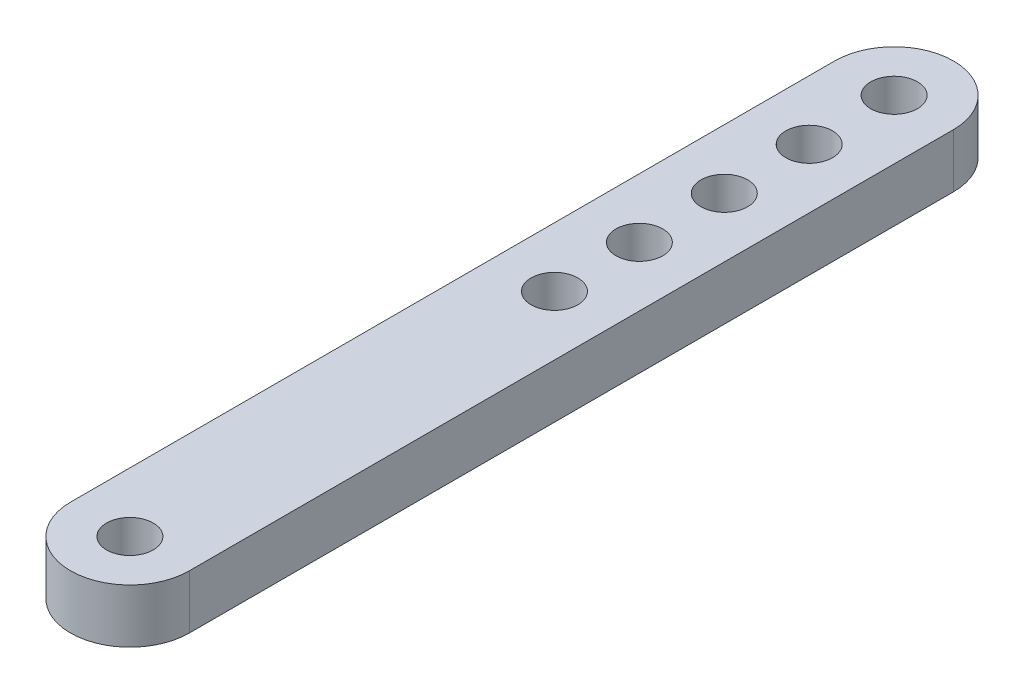
ISO-10303-21;
HEADER;
FILE_DESCRIPTION(('STEP AP214'),'2;1');
FILE_NAME('part.step','',(''),(''),'','','');
FILE_SCHEMA(('AUTOMOTIVE_DESIGN { 1 0 10303 214 1 1 1 1 }'));
ENDSEC;
DATA;
#1=APPLICATION_CONTEXT('core data for automotive mechanical design processes');
#2=APPLICATION_PROTOCOL_DEFINITION('international standard','automotive_design',2000,#1);
#3=PRODUCT_CONTEXT('',#1,'mechanical');
#4=PRODUCT('Part','Part','',(#3));
#5=PRODUCT_RELATED_PRODUCT_CATEGORY('part','',(#4));
#6=PRODUCT_DEFINITION_FORMATION('','',#4);
#7=PRODUCT_DEFINITION_CONTEXT('part definition',#1,'design');
#8=PRODUCT_DEFINITION('design','',#6,#7);
#9=PRODUCT_DEFINITION_SHAPE('','',#8);
#10=(LENGTH_UNIT() NAMED_UNIT(*) SI_UNIT(.MILLI.,.METRE.));
#11=(NAMED_UNIT(*) PLANE_ANGLE_UNIT() SI_UNIT($,.RADIAN.));
#12=(NAMED_UNIT(*) SI_UNIT($,.STERADIAN.) SOLID_ANGLE_UNIT());
#13=UNCERTAINTY_MEASURE_WITH_UNIT(LENGTH_MEASURE(1.E-05),#10,'distance_accuracy_value','');
#14=(GEOMETRIC_REPRESENTATION_CONTEXT(3) GLOBAL_UNCERTAINTY_ASSIGNED_CONTEXT((#13)) GLOBAL_UNIT_ASSIGNED_CONTEXT((#10,
#11,#12)) REPRESENTATION_CONTEXT('',''));
#15=CARTESIAN_POINT('',(0.,0.,0.));
#16=DIRECTION('',(0.,0.,1.));
#17=DIRECTION('',(1.,0.,0.));
#18=AXIS2_PLACEMENT_3D('',#15,#16,#17);
#19=CARTESIAN_POINT('',(0.,6.35,-90.));
#20=DIRECTION('',(0.,1.,0.));
#21=DIRECTION('',(0.,0.,1.));
#22=AXIS2_PLACEMENT_3D('',#19,#20,#21);
#23=PLANE('',#22);
#24=CARTESIAN_POINT('',(0.,6.35,-80.));
#25=DIRECTION('',(0.,1.,0.));
#26=DIRECTION('',(0.,0.,1.));
#27=AXIS2_PLACEMENT_3D('',#24,#25,#26);
#28=CIRCLE('',#27,2.75000000000001);
#29=CARTESIAN_POINT('',(0.,6.35,-77.25));
#30=VERTEX_POINT('',#29);
#31=EDGE_CURVE('E129',#30,#30,#28,.T.);
#32=ORIENTED_EDGE('',*,*,#31,.F.);
#33=EDGE_LOOP('',(#32));
#34=FACE_BOUND('',#33,.T.);
#35=CARTESIAN_POINT('',(0.,6.35,-70.));
#36=DIRECTION('',(0.,1.,0.));
#37=DIRECTION('',(0.,0.,1.));
#38=AXIS2_PLACEMENT_3D('',#35,#36,#37);
#39=CIRCLE('',#38,2.75000000000001);
#40=CARTESIAN_POINT('',(0.,6.35,-67.25));
#41=VERTEX_POINT('',#40);
#42=EDGE_CURVE('E147',#41,#41,#39,.T.);
#43=ORIENTED_EDGE('',*,*,#42,.F.);
#44=EDGE_LOOP('',(#43));
#45=FACE_BOUND('',#44,.T.);
#46=CARTESIAN_POINT('',(0.,6.35,-60.));
#47=DIRECTION('',(0.,1.,0.));
#48=DIRECTION('',(0.,0.,1.));
#49=AXIS2_PLACEMENT_3D('',#46,#47,#48);
#50=CIRCLE('',#49,2.75000000000001);
#51=CARTESIAN_POINT('',(0.,6.35,-57.25));
#52=VERTEX_POINT('',#51);
#53=EDGE_CURVE('E141',#52,#52,#50,.T.);
#54=ORIENTED_EDGE('',*,*,#53,.F.);
#55=EDGE_LOOP('',(#54));
#56=FACE_BOUND('',#55,.T.);
#57=CARTESIAN_POINT('',(0.,6.35,-50.));
#58=DIRECTION('',(0.,1.,0.));
#59=DIRECTION('',(0.,0.,1.));
#60=AXIS2_PLACEMENT_3D('',#57,#58,#59);
#61=CIRCLE('',#60,2.75000000000001);
#62=CARTESIAN_POINT('',(0.,6.35,-47.25));
#63=VERTEX_POINT('',#62);
#64=EDGE_CURVE('E135',#63,#63,#61,.T.);
#65=ORIENTED_EDGE('',*,*,#64,.F.);
#66=EDGE_LOOP('',(#65));
#67=FACE_BOUND('',#66,.T.);
#68=CARTESIAN_POINT('',(0.,6.35,-90.));
#69=DIRECTION('',(0.,1.,0.));
#70=DIRECTION('',(0.,0.,1.));
#71=AXIS2_PLACEMENT_3D('',#68,#69,#70);
#72=CIRCLE('',#71,2.75);
#73=CARTESIAN_POINT('',(0.,6.35,-87.25));
#74=VERTEX_POINT('',#73);
#75=EDGE_CURVE('E108',#74,#74,#72,.T.);
#76=ORIENTED_EDGE('',*,*,#75,.F.);
#77=EDGE_LOOP('',(#76));
#78=FACE_BOUND('',#77,.T.);
#79=CARTESIAN_POINT('',(0.,6.35,-90.));
#80=DIRECTION('',(0.,1.,0.));
#81=DIRECTION('',(0.,0.,1.));
#82=AXIS2_PLACEMENT_3D('',#79,#80,#81);
#83=CIRCLE('',#82,7.00000000000001);
#84=CARTESIAN_POINT('',(7.,6.35,-90.));
#85=VERTEX_POINT('',#84);
#86=CARTESIAN_POINT('',(-7.00000000000002,6.35,-90.));
#87=VERTEX_POINT('',#86);
#88=EDGE_CURVE('E93',#85,#87,#83,.T.);
#89=ORIENTED_EDGE('',*,*,#88,.T.);
#90=DIRECTION('',(0.,0.,1.));
#91=VECTOR('',#90,1.);
#92=CARTESIAN_POINT('',(-7.00000000000002,6.35,-90.));
#93=LINE('',#92,#91);
#94=CARTESIAN_POINT('',(-6.99999999999998,6.35,0.));
#95=VERTEX_POINT('',#94);
#96=EDGE_CURVE('E88',#87,#95,#93,.T.);
#97=ORIENTED_EDGE('',*,*,#96,.T.);
#98=CARTESIAN_POINT('',(0.,6.35,0.));
#99=DIRECTION('',(0.,1.,0.));
#100=DIRECTION('',(0.,0.,1.));
#101=AXIS2_PLACEMENT_3D('',#98,#99,#100);
#102=CIRCLE('',#101,6.99999999999998);
#103=CARTESIAN_POINT('',(6.99999999999999,6.35,0.));
#104=VERTEX_POINT('',#103);
#105=EDGE_CURVE('E91',#95,#104,#102,.T.);
#106=ORIENTED_EDGE('',*,*,#105,.T.);
#107=DIRECTION('',(0.,0.,-1.));
#108=VECTOR('',#107,1.);
#109=CARTESIAN_POINT('',(7.,6.35,-90.));
#110=LINE('',#109,#108);
#111=EDGE_CURVE('E58',#104,#85,#110,.T.);
#112=ORIENTED_EDGE('',*,*,#111,.T.);
#113=EDGE_LOOP('',(#89,#97,#106,#112));
#114=FACE_BOUND('',#113,.T.);
#115=CARTESIAN_POINT('',(0.,6.35,0.));
#116=DIRECTION('',(0.,1.,0.));
#117=DIRECTION('',(0.,0.,1.));
#118=AXIS2_PLACEMENT_3D('',#115,#116,#117);
#119=CIRCLE('',#118,2.75);
#120=CARTESIAN_POINT('',(0.,6.35,2.75));
#121=VERTEX_POINT('',#120);
#122=EDGE_CURVE('E123',#121,#121,#119,.T.);
#123=ORIENTED_EDGE('',*,*,#122,.F.);
#124=EDGE_LOOP('',(#123));
#125=FACE_BOUND('',#124,.T.);
#126=ADVANCED_FACE('F41',(#34,#45,#56,#67,#78,#114,#125),#23,.T.);
#127=CARTESIAN_POINT('',(0.,0.,-90.));
#128=DIRECTION('',(0.,1.,0.));
#129=DIRECTION('',(0.,0.,1.));
#130=AXIS2_PLACEMENT_3D('',#127,#128,#129);
#131=PLANE('',#130);
#132=CARTESIAN_POINT('',(0.,0.,-80.));
#133=DIRECTION('',(0.,1.,0.));
#134=DIRECTION('',(0.,0.,1.));
#135=AXIS2_PLACEMENT_3D('',#132,#133,#134);
#136=CIRCLE('',#135,2.75000000000001);
#137=CARTESIAN_POINT('',(0.,0.,-77.25));
#138=VERTEX_POINT('',#137);
#139=EDGE_CURVE('E150',#138,#138,#136,.T.);
#140=ORIENTED_EDGE('',*,*,#139,.T.);
#141=EDGE_LOOP('',(#140));
#142=FACE_BOUND('',#141,.T.);
#143=CARTESIAN_POINT('',(0.,0.,-70.));
#144=DIRECTION('',(0.,1.,0.));
#145=DIRECTION('',(0.,0.,1.));
#146=AXIS2_PLACEMENT_3D('',#143,#144,#145);
#147=CIRCLE('',#146,2.75000000000001);
#148=CARTESIAN_POINT('',(0.,0.,-67.25));
#149=VERTEX_POINT('',#148);
#150=EDGE_CURVE('E144',#149,#149,#147,.T.);
#151=ORIENTED_EDGE('',*,*,#150,.T.);
#152=EDGE_LOOP('',(#151));
#153=FACE_BOUND('',#152,.T.);
#154=CARTESIAN_POINT('',(0.,0.,-60.));
#155=DIRECTION('',(0.,1.,0.));
#156=DIRECTION('',(0.,0.,1.));
#157=AXIS2_PLACEMENT_3D('',#154,#155,#156);
#158=CIRCLE('',#157,2.75000000000001);
#159=CARTESIAN_POINT('',(0.,0.,-57.25));
#160=VERTEX_POINT('',#159);
#161=EDGE_CURVE('E138',#160,#160,#158,.T.);
#162=ORIENTED_EDGE('',*,*,#161,.T.);
#163=EDGE_LOOP('',(#162));
#164=FACE_BOUND('',#163,.T.);
#165=CARTESIAN_POINT('',(0.,0.,-50.));
#166=DIRECTION('',(0.,1.,0.));
#167=DIRECTION('',(0.,0.,1.));
#168=AXIS2_PLACEMENT_3D('',#165,#166,#167);
#169=CIRCLE('',#168,2.75000000000001);
#170=CARTESIAN_POINT('',(0.,0.,-47.25));
#171=VERTEX_POINT('',#170);
#172=EDGE_CURVE('E132',#171,#171,#169,.T.);
#173=ORIENTED_EDGE('',*,*,#172,.T.);
#174=EDGE_LOOP('',(#173));
#175=FACE_BOUND('',#174,.T.);
#176=CARTESIAN_POINT('',(0.,0.,-90.));
#177=DIRECTION('',(0.,1.,0.));
#178=DIRECTION('',(0.,0.,1.));
#179=AXIS2_PLACEMENT_3D('',#176,#177,#178);
#180=CIRCLE('',#179,7.00000000000001);
#181=CARTESIAN_POINT('',(7.,0.,-90.));
#182=VERTEX_POINT('',#181);
#183=CARTESIAN_POINT('',(-7.00000000000002,0.,-90.));
#184=VERTEX_POINT('',#183);
#185=EDGE_CURVE('E105',#182,#184,#180,.T.);
#186=ORIENTED_EDGE('',*,*,#185,.F.);
#187=DIRECTION('',(0.,0.,-1.));
#188=VECTOR('',#187,1.);
#189=CARTESIAN_POINT('',(7.,0.,-90.));
#190=LINE('',#189,#188);
#191=CARTESIAN_POINT('',(6.99999999999999,0.,0.));
#192=VERTEX_POINT('',#191);
#193=EDGE_CURVE('E81',#192,#182,#190,.T.);
#194=ORIENTED_EDGE('',*,*,#193,.F.);
#195=CARTESIAN_POINT('',(0.,0.,0.));
#196=DIRECTION('',(0.,1.,0.));
#197=DIRECTION('',(0.,0.,1.));
#198=AXIS2_PLACEMENT_3D('',#195,#196,#197);
#199=CIRCLE('',#198,6.99999999999998);
#200=CARTESIAN_POINT('',(-6.99999999999998,0.,0.));
#201=VERTEX_POINT('',#200);
#202=EDGE_CURVE('E75',#201,#192,#199,.T.);
#203=ORIENTED_EDGE('',*,*,#202,.F.);
#204=DIRECTION('',(0.,0.,1.));
#205=VECTOR('',#204,1.);
#206=CARTESIAN_POINT('',(-7.00000000000002,0.,-90.));
#207=LINE('',#206,#205);
#208=EDGE_CURVE('E97',#184,#201,#207,.T.);
#209=ORIENTED_EDGE('',*,*,#208,.F.);
#210=EDGE_LOOP('',(#186,#194,#203,#209));
#211=FACE_BOUND('',#210,.T.);
#212=CARTESIAN_POINT('',(0.,0.,-90.));
#213=DIRECTION('',(0.,1.,0.));
#214=DIRECTION('',(0.,0.,1.));
#215=AXIS2_PLACEMENT_3D('',#212,#213,#214);
#216=CIRCLE('',#215,2.75);
#217=CARTESIAN_POINT('',(0.,0.,-87.25));
#218=VERTEX_POINT('',#217);
#219=EDGE_CURVE('E120',#218,#218,#216,.T.);
#220=ORIENTED_EDGE('',*,*,#219,.T.);
#221=EDGE_LOOP('',(#220));
#222=FACE_BOUND('',#221,.T.);
#223=CARTESIAN_POINT('',(0.,0.,0.));
#224=DIRECTION('',(0.,1.,0.));
#225=DIRECTION('',(0.,0.,1.));
#226=AXIS2_PLACEMENT_3D('',#223,#224,#225);
#227=CIRCLE('',#226,2.75);
#228=CARTESIAN_POINT('',(0.,0.,2.75));
#229=VERTEX_POINT('',#228);
#230=EDGE_CURVE('E126',#229,#229,#227,.T.);
#231=ORIENTED_EDGE('',*,*,#230,.T.);
#232=EDGE_LOOP('',(#231));
#233=FACE_BOUND('',#232,.T.);
#234=ADVANCED_FACE('F116',(#142,#153,#164,#175,#211,#222,#233),#131,.F.);
#235=CARTESIAN_POINT('',(0.,6.35,-90.));
#236=DIRECTION('',(0.,-1.,0.));
#237=DIRECTION('',(0.,0.,-1.));
#238=AXIS2_PLACEMENT_3D('',#235,#236,#237);
#239=CYLINDRICAL_SURFACE('',#238,7.00000000000001);
#240=ORIENTED_EDGE('',*,*,#185,.T.);
#241=DIRECTION('',(0.,-1.,0.));
#242=VECTOR('',#241,1.);
#243=CARTESIAN_POINT('',(-7.00000000000002,6.35,-90.));
#244=LINE('',#243,#242);
#245=EDGE_CURVE('E11',#87,#184,#244,.T.);
#246=ORIENTED_EDGE('',*,*,#245,.F.);
#247=ORIENTED_EDGE('',*,*,#88,.F.);
#248=DIRECTION('',(0.,-1.,0.));
#249=VECTOR('',#248,1.);
#250=CARTESIAN_POINT('',(7.,6.35,-90.));
#251=LINE('',#250,#249);
#252=EDGE_CURVE('E101',#85,#182,#251,.T.);
#253=ORIENTED_EDGE('',*,*,#252,.T.);
#254=EDGE_LOOP('',(#240,#246,#247,#253));
#255=FACE_BOUND('',#254,.T.);
#256=ADVANCED_FACE('F43',(#255),#239,.T.);
#257=CARTESIAN_POINT('',(-7.00000000000002,6.35,-90.));
#258=DIRECTION('',(1.,0.,0.));
#259=DIRECTION('',(0.,0.,-1.));
#260=AXIS2_PLACEMENT_3D('',#257,#258,#259);
#261=PLANE('',#260);
#262=ORIENTED_EDGE('',*,*,#208,.T.);
#263=DIRECTION('',(0.,-1.,0.));
#264=VECTOR('',#263,1.);
#265=CARTESIAN_POINT('',(-6.99999999999998,6.35,0.));
#266=LINE('',#265,#264);
#267=EDGE_CURVE('E50',#95,#201,#266,.T.);
#268=ORIENTED_EDGE('',*,*,#267,.F.);
#269=ORIENTED_EDGE('',*,*,#96,.F.);
#270=ORIENTED_EDGE('',*,*,#245,.T.);
#271=EDGE_LOOP('',(#262,#268,#269,#270));
#272=FACE_BOUND('',#271,.T.);
#273=ADVANCED_FACE('F96',(#272),#261,.F.);
#274=CARTESIAN_POINT('',(0.,6.35,0.));
#275=DIRECTION('',(0.,-1.,0.));
#276=DIRECTION('',(0.,0.,-1.));
#277=AXIS2_PLACEMENT_3D('',#274,#275,#276);
#278=CYLINDRICAL_SURFACE('',#277,6.99999999999998);
#279=ORIENTED_EDGE('',*,*,#202,.T.);
#280=DIRECTION('',(0.,-1.,0.));
#281=VECTOR('',#280,1.);
#282=CARTESIAN_POINT('',(6.99999999999999,6.35,0.));
#283=LINE('',#282,#281);
#284=EDGE_CURVE('E98',#104,#192,#283,.T.);
#285=ORIENTED_EDGE('',*,*,#284,.F.);
#286=ORIENTED_EDGE('',*,*,#105,.F.);
#287=ORIENTED_EDGE('',*,*,#267,.T.);
#288=EDGE_LOOP('',(#279,#285,#286,#287));
#289=FACE_BOUND('',#288,.T.);
#290=ADVANCED_FACE('F99',(#289),#278,.T.);
#291=CARTESIAN_POINT('',(7.,6.35,-90.));
#292=DIRECTION('',(-1.,0.,0.));
#293=DIRECTION('',(0.,0.,1.));
#294=AXIS2_PLACEMENT_3D('',#291,#292,#293);
#295=PLANE('',#294);
#296=ORIENTED_EDGE('',*,*,#193,.T.);
#297=ORIENTED_EDGE('',*,*,#252,.F.);
#298=ORIENTED_EDGE('',*,*,#111,.F.);
#299=ORIENTED_EDGE('',*,*,#284,.T.);
#300=EDGE_LOOP('',(#296,#297,#298,#299));
#301=FACE_BOUND('',#300,.T.);
#302=ADVANCED_FACE('F113',(#301),#295,.F.);
#303=CARTESIAN_POINT('',(0.,6.35,-90.));
#304=DIRECTION('',(0.,-1.,0.));
#305=DIRECTION('',(0.,0.,-1.));
#306=AXIS2_PLACEMENT_3D('',#303,#304,#305);
#307=CYLINDRICAL_SURFACE('',#306,2.75);
#308=ORIENTED_EDGE('',*,*,#75,.T.);
#309=EDGE_LOOP('',(#308));
#310=FACE_BOUND('',#309,.T.);
#311=ORIENTED_EDGE('',*,*,#219,.F.);
#312=EDGE_LOOP('',(#311));
#313=FACE_BOUND('',#312,.T.);
#314=ADVANCED_FACE('F170',(#310,#313),#307,.F.);
#315=CARTESIAN_POINT('',(0.,6.35,0.));
#316=DIRECTION('',(0.,-1.,0.));
#317=DIRECTION('',(0.,0.,-1.));
#318=AXIS2_PLACEMENT_3D('',#315,#316,#317);
#319=CYLINDRICAL_SURFACE('',#318,2.75);
#320=ORIENTED_EDGE('',*,*,#122,.T.);
#321=EDGE_LOOP('',(#320));
#322=FACE_BOUND('',#321,.T.);
#323=ORIENTED_EDGE('',*,*,#230,.F.);
#324=EDGE_LOOP('',(#323));
#325=FACE_BOUND('',#324,.T.);
#326=ADVANCED_FACE('F173',(#322,#325),#319,.F.);
#327=CARTESIAN_POINT('',(0.,6.35,-50.));
#328=DIRECTION('',(0.,-1.,0.));
#329=DIRECTION('',(0.,0.,-1.));
#330=AXIS2_PLACEMENT_3D('',#327,#328,#329);
#331=CYLINDRICAL_SURFACE('',#330,2.75000000000001);
#332=ORIENTED_EDGE('',*,*,#64,.T.);
#333=EDGE_LOOP('',(#332));
#334=FACE_BOUND('',#333,.T.);
#335=ORIENTED_EDGE('',*,*,#172,.F.);
#336=EDGE_LOOP('',(#335));
#337=FACE_BOUND('',#336,.T.);
#338=ADVANCED_FACE('F183',(#334,#337),#331,.F.);
#339=CARTESIAN_POINT('',(0.,6.35,-60.));
#340=DIRECTION('',(0.,-1.,0.));
#341=DIRECTION('',(0.,0.,-1.));
#342=AXIS2_PLACEMENT_3D('',#339,#340,#341);
#343=CYLINDRICAL_SURFACE('',#342,2.75000000000001);
#344=ORIENTED_EDGE('',*,*,#53,.T.);
#345=EDGE_LOOP('',(#344));
#346=FACE_BOUND('',#345,.T.);
#347=ORIENTED_EDGE('',*,*,#161,.F.);
#348=EDGE_LOOP('',(#347));
#349=FACE_BOUND('',#348,.T.);
#350=ADVANCED_FACE('F189',(#346,#349),#343,.F.);
#351=CARTESIAN_POINT('',(0.,6.35,-70.));
#352=DIRECTION('',(0.,-1.,0.));
#353=DIRECTION('',(0.,0.,-1.));
#354=AXIS2_PLACEMENT_3D('',#351,#352,#353);
#355=CYLINDRICAL_SURFACE('',#354,2.75000000000001);
#356=ORIENTED_EDGE('',*,*,#42,.T.);
#357=EDGE_LOOP('',(#356));
#358=FACE_BOUND('',#357,.T.);
#359=ORIENTED_EDGE('',*,*,#150,.F.);
#360=EDGE_LOOP('',(#359));
#361=FACE_BOUND('',#360,.T.);
#362=ADVANCED_FACE('F256',(#358,#361),#355,.F.);
#363=CARTESIAN_POINT('',(0.,6.35,-80.));
#364=DIRECTION('',(0.,-1.,0.));
#365=DIRECTION('',(0.,0.,-1.));
#366=AXIS2_PLACEMENT_3D('',#363,#364,#365);
#367=CYLINDRICAL_SURFACE('',#366,2.75000000000001);
#368=ORIENTED_EDGE('',*,*,#31,.T.);
#369=EDGE_LOOP('',(#368));
#370=FACE_BOUND('',#369,.T.);
#371=ORIENTED_EDGE('',*,*,#139,.F.);
#372=EDGE_LOOP('',(#371));
#373=FACE_BOUND('',#372,.T.);
#374=ADVANCED_FACE('F156',(#370,#373),#367,.F.);
#375=CLOSED_SHELL('',(#126,#234,#256,#273,#290,#302,#314,#326,#338,#350,#362,#374));
#376=MANIFOLD_SOLID_BREP('B2',#375);
#377=ADVANCED_BREP_SHAPE_REPRESENTATION('',(#18,#376),#14);
#378=SHAPE_DEFINITION_REPRESENTATION(#9,#377);
ENDSEC;
END-ISO-10303-21;
